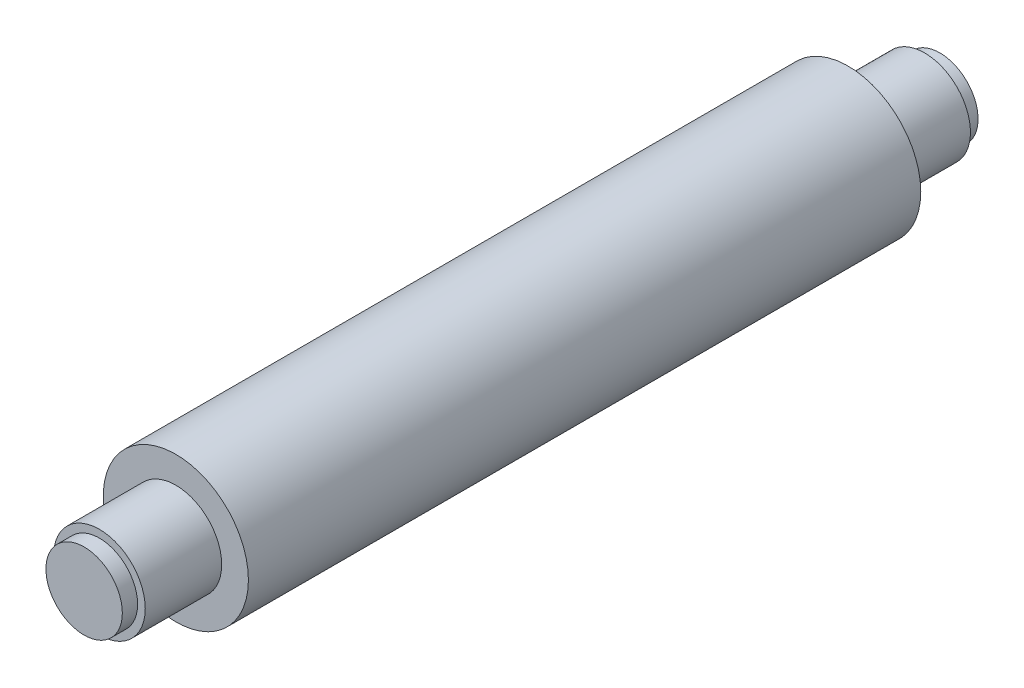
ISO-10303-21;
HEADER;
FILE_DESCRIPTION(('STEP AP214'),'2;1');
FILE_NAME('part.step','',(''),(''),'','','');
FILE_SCHEMA(('AUTOMOTIVE_DESIGN { 1 0 10303 214 1 1 1 1 }'));
ENDSEC;
DATA;
#1=APPLICATION_CONTEXT('core data for automotive mechanical design processes');
#2=APPLICATION_PROTOCOL_DEFINITION('international standard','automotive_design',2000,#1);
#3=PRODUCT_CONTEXT('',#1,'mechanical');
#4=PRODUCT('Part','Part','',(#3));
#5=PRODUCT_RELATED_PRODUCT_CATEGORY('part','',(#4));
#6=PRODUCT_DEFINITION_FORMATION('','',#4);
#7=PRODUCT_DEFINITION_CONTEXT('part definition',#1,'design');
#8=PRODUCT_DEFINITION('design','',#6,#7);
#9=PRODUCT_DEFINITION_SHAPE('','',#8);
#10=(LENGTH_UNIT() NAMED_UNIT(*) SI_UNIT(.MILLI.,.METRE.));
#11=(NAMED_UNIT(*) PLANE_ANGLE_UNIT() SI_UNIT($,.RADIAN.));
#12=(NAMED_UNIT(*) SI_UNIT($,.STERADIAN.) SOLID_ANGLE_UNIT());
#13=UNCERTAINTY_MEASURE_WITH_UNIT(LENGTH_MEASURE(1.E-05),#10,'distance_accuracy_value','');
#14=(GEOMETRIC_REPRESENTATION_CONTEXT(3) GLOBAL_UNCERTAINTY_ASSIGNED_CONTEXT((#13)) GLOBAL_UNIT_ASSIGNED_CONTEXT((#10,
#11,#12)) REPRESENTATION_CONTEXT('',''));
#15=CARTESIAN_POINT('',(0.,0.,0.));
#16=DIRECTION('',(0.,0.,1.));
#17=DIRECTION('',(1.,0.,0.));
#18=AXIS2_PLACEMENT_3D('',#15,#16,#17);
#19=CARTESIAN_POINT('',(0.,0.,440.));
#20=DIRECTION('',(0.,0.,-1.));
#21=DIRECTION('',(-1.,0.,0.));
#22=AXIS2_PLACEMENT_3D('',#19,#20,#21);
#23=CYLINDRICAL_SURFACE('',#22,47.5);
#24=CARTESIAN_POINT('',(0.,0.,440.));
#25=DIRECTION('',(0.,0.,1.));
#26=DIRECTION('',(1.,0.,0.));
#27=AXIS2_PLACEMENT_3D('',#24,#25,#26);
#28=CIRCLE('',#27,47.5);
#29=CARTESIAN_POINT('',(47.5,0.,440.));
#30=VERTEX_POINT('',#29);
#31=EDGE_CURVE('E74',#30,#30,#28,.T.);
#32=ORIENTED_EDGE('',*,*,#31,.F.);
#33=EDGE_LOOP('',(#32));
#34=FACE_BOUND('',#33,.T.);
#35=CARTESIAN_POINT('',(0.,0.,0.));
#36=DIRECTION('',(0.,0.,1.));
#37=DIRECTION('',(1.,0.,0.));
#38=AXIS2_PLACEMENT_3D('',#35,#36,#37);
#39=CIRCLE('',#38,47.5);
#40=CARTESIAN_POINT('',(47.5,0.,0.));
#41=VERTEX_POINT('',#40);
#42=EDGE_CURVE('E40',#41,#41,#39,.T.);
#43=ORIENTED_EDGE('',*,*,#42,.T.);
#44=EDGE_LOOP('',(#43));
#45=FACE_BOUND('',#44,.T.);
#46=ADVANCED_FACE('F37',(#34,#45),#23,.T.);
#47=CARTESIAN_POINT('',(0.,0.,440.));
#48=DIRECTION('',(0.,0.,1.));
#49=DIRECTION('',(1.,0.,0.));
#50=AXIS2_PLACEMENT_3D('',#47,#48,#49);
#51=PLANE('',#50);
#52=CARTESIAN_POINT('',(0.,0.,440.));
#53=DIRECTION('',(0.,0.,1.));
#54=DIRECTION('',(1.,0.,0.));
#55=AXIS2_PLACEMENT_3D('',#52,#53,#54);
#56=CIRCLE('',#55,30.);
#57=CARTESIAN_POINT('',(30.,0.,440.));
#58=VERTEX_POINT('',#57);
#59=EDGE_CURVE('E51',#58,#58,#56,.T.);
#60=ORIENTED_EDGE('',*,*,#59,.F.);
#61=EDGE_LOOP('',(#60));
#62=FACE_BOUND('',#61,.T.);
#63=ORIENTED_EDGE('',*,*,#31,.T.);
#64=EDGE_LOOP('',(#63));
#65=FACE_BOUND('',#64,.T.);
#66=ADVANCED_FACE('F87',(#62,#65),#51,.T.);
#67=CARTESIAN_POINT('',(0.,0.,0.));
#68=DIRECTION('',(0.,0.,1.));
#69=DIRECTION('',(1.,0.,0.));
#70=AXIS2_PLACEMENT_3D('',#67,#68,#69);
#71=PLANE('',#70);
#72=CARTESIAN_POINT('',(0.,0.,0.));
#73=DIRECTION('',(0.,0.,-1.));
#74=DIRECTION('',(-1.,0.,0.));
#75=AXIS2_PLACEMENT_3D('',#72,#73,#74);
#76=CIRCLE('',#75,30.);
#77=CARTESIAN_POINT('',(-30.,0.,0.));
#78=VERTEX_POINT('',#77);
#79=EDGE_CURVE('E68',#78,#78,#76,.T.);
#80=ORIENTED_EDGE('',*,*,#79,.F.);
#81=EDGE_LOOP('',(#80));
#82=FACE_BOUND('',#81,.T.);
#83=ORIENTED_EDGE('',*,*,#42,.F.);
#84=EDGE_LOOP('',(#83));
#85=FACE_BOUND('',#84,.T.);
#86=ADVANCED_FACE('F84',(#82,#85),#71,.F.);
#87=CARTESIAN_POINT('',(0.,0.,-50.));
#88=DIRECTION('',(0.,0.,1.));
#89=DIRECTION('',(1.,0.,0.));
#90=AXIS2_PLACEMENT_3D('',#87,#88,#89);
#91=CYLINDRICAL_SURFACE('',#90,30.);
#92=CARTESIAN_POINT('',(0.,0.,-50.));
#93=DIRECTION('',(0.,0.,-1.));
#94=DIRECTION('',(-1.,0.,0.));
#95=AXIS2_PLACEMENT_3D('',#92,#93,#94);
#96=CIRCLE('',#95,30.);
#97=CARTESIAN_POINT('',(-30.,0.,-50.));
#98=VERTEX_POINT('',#97);
#99=EDGE_CURVE('E64',#98,#98,#96,.T.);
#100=ORIENTED_EDGE('',*,*,#99,.F.);
#101=EDGE_LOOP('',(#100));
#102=FACE_BOUND('',#101,.T.);
#103=ORIENTED_EDGE('',*,*,#79,.T.);
#104=EDGE_LOOP('',(#103));
#105=FACE_BOUND('',#104,.T.);
#106=ADVANCED_FACE('F86',(#102,#105),#91,.T.);
#107=CARTESIAN_POINT('',(0.,0.,-50.));
#108=DIRECTION('',(0.,0.,-1.));
#109=DIRECTION('',(-1.,0.,0.));
#110=AXIS2_PLACEMENT_3D('',#107,#108,#109);
#111=PLANE('',#110);
#112=CARTESIAN_POINT('',(0.,0.,-50.));
#113=DIRECTION('',(0.,0.,-1.));
#114=DIRECTION('',(-1.,0.,0.));
#115=AXIS2_PLACEMENT_3D('',#112,#113,#114);
#116=CIRCLE('',#115,25.);
#117=CARTESIAN_POINT('',(-25.,0.,-50.));
#118=VERTEX_POINT('',#117);
#119=EDGE_CURVE('E10',#118,#118,#116,.T.);
#120=ORIENTED_EDGE('',*,*,#119,.F.);
#121=EDGE_LOOP('',(#120));
#122=FACE_BOUND('',#121,.T.);
#123=ORIENTED_EDGE('',*,*,#99,.T.);
#124=EDGE_LOOP('',(#123));
#125=FACE_BOUND('',#124,.T.);
#126=ADVANCED_FACE('F93',(#122,#125),#111,.T.);
#127=CARTESIAN_POINT('',(0.,0.,490.));
#128=DIRECTION('',(0.,0.,-1.));
#129=DIRECTION('',(-1.,0.,0.));
#130=AXIS2_PLACEMENT_3D('',#127,#128,#129);
#131=CYLINDRICAL_SURFACE('',#130,30.);
#132=CARTESIAN_POINT('',(0.,0.,490.));
#133=DIRECTION('',(0.,0.,1.));
#134=DIRECTION('',(1.,0.,0.));
#135=AXIS2_PLACEMENT_3D('',#132,#133,#134);
#136=CIRCLE('',#135,30.);
#137=CARTESIAN_POINT('',(30.,0.,490.));
#138=VERTEX_POINT('',#137);
#139=EDGE_CURVE('E59',#138,#138,#136,.T.);
#140=ORIENTED_EDGE('',*,*,#139,.F.);
#141=EDGE_LOOP('',(#140));
#142=FACE_BOUND('',#141,.T.);
#143=ORIENTED_EDGE('',*,*,#59,.T.);
#144=EDGE_LOOP('',(#143));
#145=FACE_BOUND('',#144,.T.);
#146=ADVANCED_FACE('F116',(#142,#145),#131,.T.);
#147=CARTESIAN_POINT('',(0.,0.,490.));
#148=DIRECTION('',(0.,0.,1.));
#149=DIRECTION('',(1.,0.,0.));
#150=AXIS2_PLACEMENT_3D('',#147,#148,#149);
#151=PLANE('',#150);
#152=CARTESIAN_POINT('',(0.,0.,490.));
#153=DIRECTION('',(0.,0.,1.));
#154=DIRECTION('',(1.,0.,0.));
#155=AXIS2_PLACEMENT_3D('',#152,#153,#154);
#156=CIRCLE('',#155,25.);
#157=CARTESIAN_POINT('',(25.,0.,490.));
#158=VERTEX_POINT('',#157);
#159=EDGE_CURVE('E45',#158,#158,#156,.T.);
#160=ORIENTED_EDGE('',*,*,#159,.F.);
#161=EDGE_LOOP('',(#160));
#162=FACE_BOUND('',#161,.T.);
#163=ORIENTED_EDGE('',*,*,#139,.T.);
#164=EDGE_LOOP('',(#163));
#165=FACE_BOUND('',#164,.T.);
#166=ADVANCED_FACE('F121',(#162,#165),#151,.T.);
#167=CARTESIAN_POINT('',(0.,0.,500.));
#168=DIRECTION('',(0.,0.,-1.));
#169=DIRECTION('',(-1.,0.,0.));
#170=AXIS2_PLACEMENT_3D('',#167,#168,#169);
#171=CYLINDRICAL_SURFACE('',#170,25.);
#172=CARTESIAN_POINT('',(0.,0.,500.));
#173=DIRECTION('',(0.,0.,1.));
#174=DIRECTION('',(1.,0.,0.));
#175=AXIS2_PLACEMENT_3D('',#172,#173,#174);
#176=CIRCLE('',#175,25.);
#177=CARTESIAN_POINT('',(25.,0.,500.));
#178=VERTEX_POINT('',#177);
#179=EDGE_CURVE('E56',#178,#178,#176,.T.);
#180=ORIENTED_EDGE('',*,*,#179,.F.);
#181=EDGE_LOOP('',(#180));
#182=FACE_BOUND('',#181,.T.);
#183=ORIENTED_EDGE('',*,*,#159,.T.);
#184=EDGE_LOOP('',(#183));
#185=FACE_BOUND('',#184,.T.);
#186=ADVANCED_FACE('F133',(#182,#185),#171,.T.);
#187=CARTESIAN_POINT('',(0.,0.,500.));
#188=DIRECTION('',(0.,0.,1.));
#189=DIRECTION('',(1.,0.,0.));
#190=AXIS2_PLACEMENT_3D('',#187,#188,#189);
#191=PLANE('',#190);
#192=ORIENTED_EDGE('',*,*,#179,.T.);
#193=EDGE_LOOP('',(#192));
#194=FACE_BOUND('',#193,.T.);
#195=ADVANCED_FACE('F143',(#194),#191,.T.);
#196=CARTESIAN_POINT('',(0.,0.,-60.));
#197=DIRECTION('',(0.,0.,1.));
#198=DIRECTION('',(1.,0.,0.));
#199=AXIS2_PLACEMENT_3D('',#196,#197,#198);
#200=CYLINDRICAL_SURFACE('',#199,25.);
#201=CARTESIAN_POINT('',(0.,0.,-60.));
#202=DIRECTION('',(0.,0.,-1.));
#203=DIRECTION('',(-1.,0.,0.));
#204=AXIS2_PLACEMENT_3D('',#201,#202,#203);
#205=CIRCLE('',#204,25.);
#206=CARTESIAN_POINT('',(-25.,0.,-60.));
#207=VERTEX_POINT('',#206);
#208=EDGE_CURVE('E55',#207,#207,#205,.T.);
#209=ORIENTED_EDGE('',*,*,#208,.F.);
#210=EDGE_LOOP('',(#209));
#211=FACE_BOUND('',#210,.T.);
#212=ORIENTED_EDGE('',*,*,#119,.T.);
#213=EDGE_LOOP('',(#212));
#214=FACE_BOUND('',#213,.T.);
#215=ADVANCED_FACE('F153',(#211,#214),#200,.T.);
#216=CARTESIAN_POINT('',(0.,0.,-60.));
#217=DIRECTION('',(0.,0.,-1.));
#218=DIRECTION('',(-1.,0.,0.));
#219=AXIS2_PLACEMENT_3D('',#216,#217,#218);
#220=PLANE('',#219);
#221=ORIENTED_EDGE('',*,*,#208,.T.);
#222=EDGE_LOOP('',(#221));
#223=FACE_BOUND('',#222,.T.);
#224=ADVANCED_FACE('F170',(#223),#220,.T.);
#225=CLOSED_SHELL('',(#46,#66,#86,#106,#126,#146,#166,#186,#195,#215,#224));
#226=MANIFOLD_SOLID_BREP('B2',#225);
#227=ADVANCED_BREP_SHAPE_REPRESENTATION('',(#18,#226),#14);
#228=SHAPE_DEFINITION_REPRESENTATION(#9,#227);
ENDSEC;
END-ISO-10303-21;
